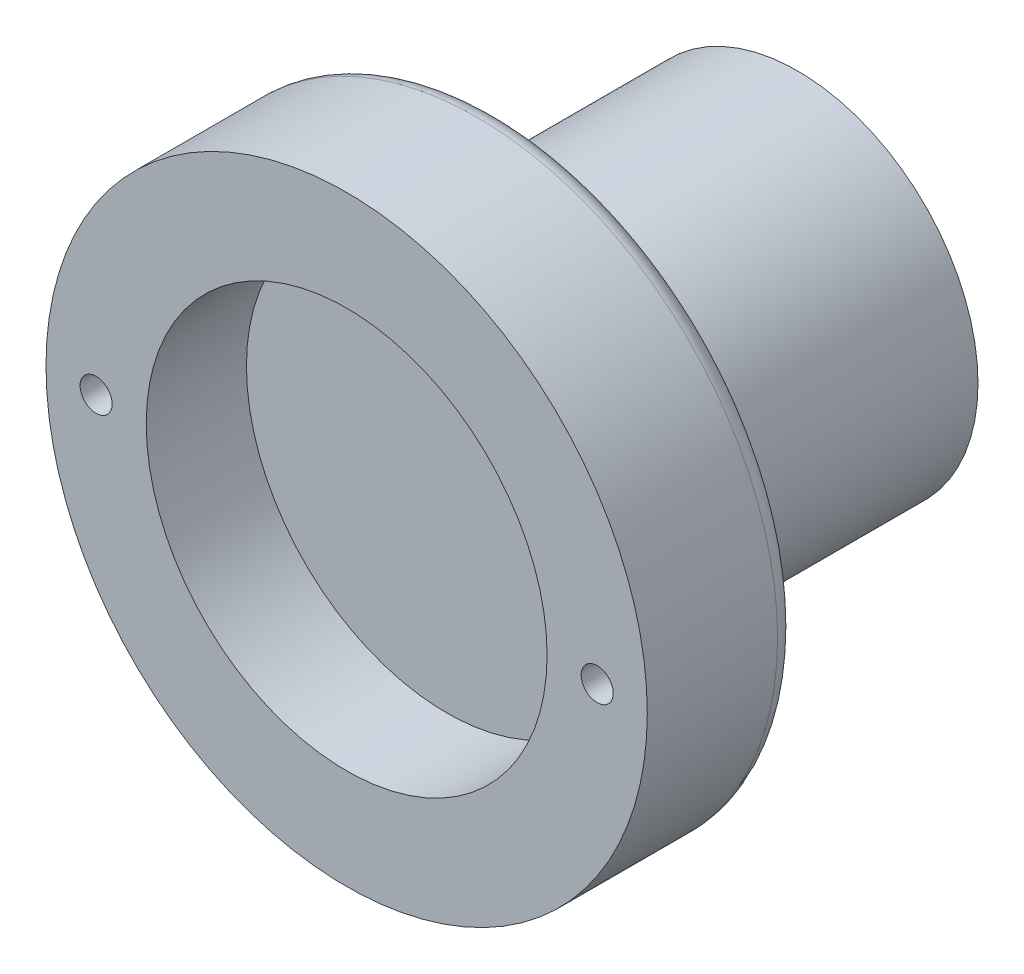
ISO-10303-21;
HEADER;
FILE_DESCRIPTION(('STEP AP214'),'2;1');
FILE_NAME('part.step','',(''),(''),'','','');
FILE_SCHEMA(('AUTOMOTIVE_DESIGN { 1 0 10303 214 1 1 1 1 }'));
ENDSEC;
DATA;
#1=APPLICATION_CONTEXT('core data for automotive mechanical design processes');
#2=APPLICATION_PROTOCOL_DEFINITION('international standard','automotive_design',2000,#1);
#3=PRODUCT_CONTEXT('',#1,'mechanical');
#4=PRODUCT('Part','Part','',(#3));
#5=PRODUCT_RELATED_PRODUCT_CATEGORY('part','',(#4));
#6=PRODUCT_DEFINITION_FORMATION('','',#4);
#7=PRODUCT_DEFINITION_CONTEXT('part definition',#1,'design');
#8=PRODUCT_DEFINITION('design','',#6,#7);
#9=PRODUCT_DEFINITION_SHAPE('','',#8);
#10=(LENGTH_UNIT() NAMED_UNIT(*) SI_UNIT(.MILLI.,.METRE.));
#11=(NAMED_UNIT(*) PLANE_ANGLE_UNIT() SI_UNIT($,.RADIAN.));
#12=(NAMED_UNIT(*) SI_UNIT($,.STERADIAN.) SOLID_ANGLE_UNIT());
#13=UNCERTAINTY_MEASURE_WITH_UNIT(LENGTH_MEASURE(1.E-05),#10,'distance_accuracy_value','');
#14=(GEOMETRIC_REPRESENTATION_CONTEXT(3) GLOBAL_UNCERTAINTY_ASSIGNED_CONTEXT((#13)) GLOBAL_UNIT_ASSIGNED_CONTEXT((#10,
#11,#12)) REPRESENTATION_CONTEXT('',''));
#15=CARTESIAN_POINT('',(0.,0.,0.));
#16=DIRECTION('',(0.,0.,1.));
#17=DIRECTION('',(1.,0.,0.));
#18=AXIS2_PLACEMENT_3D('',#15,#16,#17);
#19=CARTESIAN_POINT('',(0.,0.,2.));
#20=DIRECTION('',(0.,0.,1.));
#21=DIRECTION('',(1.,0.,0.));
#22=AXIS2_PLACEMENT_3D('',#19,#20,#21);
#23=TOROIDAL_SURFACE('',#22,28.,2.);
#24=CARTESIAN_POINT('',(0.,0.,0.));
#25=DIRECTION('',(0.,0.,1.));
#26=DIRECTION('',(1.,0.,0.));
#27=AXIS2_PLACEMENT_3D('',#24,#25,#26);
#28=CIRCLE('',#27,28.);
#29=CARTESIAN_POINT('',(28.,0.,0.));
#30=VERTEX_POINT('',#29);
#31=EDGE_CURVE('E40',#30,#30,#28,.F.);
#32=ORIENTED_EDGE('',*,*,#31,.F.);
#33=EDGE_LOOP('',(#32));
#34=FACE_BOUND('',#33,.T.);
#35=CARTESIAN_POINT('',(0.,0.,2.));
#36=DIRECTION('',(0.,0.,1.));
#37=DIRECTION('',(1.,0.,0.));
#38=AXIS2_PLACEMENT_3D('',#35,#36,#37);
#39=CIRCLE('',#38,30.);
#40=CARTESIAN_POINT('',(30.,0.,2.));
#41=VERTEX_POINT('',#40);
#42=EDGE_CURVE('E10',#41,#41,#39,.T.);
#43=ORIENTED_EDGE('',*,*,#42,.F.);
#44=EDGE_LOOP('',(#43));
#45=FACE_BOUND('',#44,.T.);
#46=ADVANCED_FACE('F34',(#34,#45),#23,.T.);
#47=CARTESIAN_POINT('',(0.,0.,15.));
#48=DIRECTION('',(0.,0.,1.));
#49=DIRECTION('',(1.,0.,0.));
#50=AXIS2_PLACEMENT_3D('',#47,#48,#49);
#51=PLANE('',#50);
#52=CARTESIAN_POINT('',(0.,0.,15.));
#53=DIRECTION('',(0.,0.,1.));
#54=DIRECTION('',(1.,0.,0.));
#55=AXIS2_PLACEMENT_3D('',#52,#53,#54);
#56=CIRCLE('',#55,20.);
#57=CARTESIAN_POINT('',(20.,0.,15.));
#58=VERTEX_POINT('',#57);
#59=EDGE_CURVE('E66',#58,#58,#56,.T.);
#60=ORIENTED_EDGE('',*,*,#59,.F.);
#61=EDGE_LOOP('',(#60));
#62=FACE_BOUND('',#61,.T.);
#63=CARTESIAN_POINT('',(-25.,0.,15.));
#64=DIRECTION('',(0.,0.,1.));
#65=DIRECTION('',(1.,0.,0.));
#66=AXIS2_PLACEMENT_3D('',#63,#64,#65);
#67=CIRCLE('',#66,1.6);
#68=CARTESIAN_POINT('',(-23.4,0.,15.));
#69=VERTEX_POINT('',#68);
#70=EDGE_CURVE('E53',#69,#69,#67,.T.);
#71=ORIENTED_EDGE('',*,*,#70,.F.);
#72=EDGE_LOOP('',(#71));
#73=FACE_BOUND('',#72,.T.);
#74=CARTESIAN_POINT('',(0.,0.,15.));
#75=DIRECTION('',(0.,0.,1.));
#76=DIRECTION('',(1.,0.,0.));
#77=AXIS2_PLACEMENT_3D('',#74,#75,#76);
#78=CIRCLE('',#77,30.);
#79=CARTESIAN_POINT('',(30.,0.,15.));
#80=VERTEX_POINT('',#79);
#81=EDGE_CURVE('E48',#80,#80,#78,.T.);
#82=ORIENTED_EDGE('',*,*,#81,.T.);
#83=EDGE_LOOP('',(#82));
#84=FACE_BOUND('',#83,.T.);
#85=CARTESIAN_POINT('',(25.,0.,15.));
#86=DIRECTION('',(0.,0.,1.));
#87=DIRECTION('',(1.,0.,0.));
#88=AXIS2_PLACEMENT_3D('',#85,#86,#87);
#89=CIRCLE('',#88,1.6);
#90=CARTESIAN_POINT('',(26.6,0.,15.));
#91=VERTEX_POINT('',#90);
#92=EDGE_CURVE('E57',#91,#91,#89,.T.);
#93=ORIENTED_EDGE('',*,*,#92,.F.);
#94=EDGE_LOOP('',(#93));
#95=FACE_BOUND('',#94,.T.);
#96=ADVANCED_FACE('F106',(#62,#73,#84,#95),#51,.T.);
#97=CARTESIAN_POINT('',(0.,0.,0.));
#98=DIRECTION('',(0.,0.,1.));
#99=DIRECTION('',(1.,0.,0.));
#100=AXIS2_PLACEMENT_3D('',#97,#98,#99);
#101=PLANE('',#100);
#102=ORIENTED_EDGE('',*,*,#31,.T.);
#103=EDGE_LOOP('',(#102));
#104=FACE_BOUND('',#103,.T.);
#105=CARTESIAN_POINT('',(0.,0.,0.));
#106=DIRECTION('',(0.,0.,-1.));
#107=DIRECTION('',(-1.,0.,0.));
#108=AXIS2_PLACEMENT_3D('',#105,#106,#107);
#109=CIRCLE('',#108,18.);
#110=CARTESIAN_POINT('',(-18.,0.,0.));
#111=VERTEX_POINT('',#110);
#112=EDGE_CURVE('E44',#111,#111,#109,.T.);
#113=ORIENTED_EDGE('',*,*,#112,.F.);
#114=EDGE_LOOP('',(#113));
#115=FACE_BOUND('',#114,.T.);
#116=CARTESIAN_POINT('',(-25.,0.,0.));
#117=DIRECTION('',(0.,0.,1.));
#118=DIRECTION('',(1.,0.,0.));
#119=AXIS2_PLACEMENT_3D('',#116,#117,#118);
#120=CIRCLE('',#119,1.6);
#121=CARTESIAN_POINT('',(-23.4,0.,0.));
#122=VERTEX_POINT('',#121);
#123=EDGE_CURVE('E54',#122,#122,#120,.T.);
#124=ORIENTED_EDGE('',*,*,#123,.T.);
#125=EDGE_LOOP('',(#124));
#126=FACE_BOUND('',#125,.T.);
#127=CARTESIAN_POINT('',(25.,0.,0.));
#128=DIRECTION('',(0.,0.,1.));
#129=DIRECTION('',(1.,0.,0.));
#130=AXIS2_PLACEMENT_3D('',#127,#128,#129);
#131=CIRCLE('',#130,1.6);
#132=CARTESIAN_POINT('',(26.6,0.,0.));
#133=VERTEX_POINT('',#132);
#134=EDGE_CURVE('E60',#133,#133,#131,.T.);
#135=ORIENTED_EDGE('',*,*,#134,.T.);
#136=EDGE_LOOP('',(#135));
#137=FACE_BOUND('',#136,.T.);
#138=ADVANCED_FACE('F102',(#104,#115,#126,#137),#101,.F.);
#139=CARTESIAN_POINT('',(0.,0.,15.));
#140=DIRECTION('',(0.,0.,-1.));
#141=DIRECTION('',(-1.,0.,0.));
#142=AXIS2_PLACEMENT_3D('',#139,#140,#141);
#143=CYLINDRICAL_SURFACE('',#142,30.);
#144=ORIENTED_EDGE('',*,*,#42,.T.);
#145=EDGE_LOOP('',(#144));
#146=FACE_BOUND('',#145,.T.);
#147=ORIENTED_EDGE('',*,*,#81,.F.);
#148=EDGE_LOOP('',(#147));
#149=FACE_BOUND('',#148,.T.);
#150=ADVANCED_FACE('F105',(#146,#149),#143,.T.);
#151=CARTESIAN_POINT('',(-25.,0.,15.));
#152=DIRECTION('',(0.,0.,-1.));
#153=DIRECTION('',(-1.,0.,0.));
#154=AXIS2_PLACEMENT_3D('',#151,#152,#153);
#155=CYLINDRICAL_SURFACE('',#154,1.6);
#156=ORIENTED_EDGE('',*,*,#70,.T.);
#157=EDGE_LOOP('',(#156));
#158=FACE_BOUND('',#157,.T.);
#159=ORIENTED_EDGE('',*,*,#123,.F.);
#160=EDGE_LOOP('',(#159));
#161=FACE_BOUND('',#160,.T.);
#162=ADVANCED_FACE('F115',(#158,#161),#155,.F.);
#163=CARTESIAN_POINT('',(25.,0.,15.));
#164=DIRECTION('',(0.,0.,-1.));
#165=DIRECTION('',(-1.,0.,0.));
#166=AXIS2_PLACEMENT_3D('',#163,#164,#165);
#167=CYLINDRICAL_SURFACE('',#166,1.6);
#168=ORIENTED_EDGE('',*,*,#92,.T.);
#169=EDGE_LOOP('',(#168));
#170=FACE_BOUND('',#169,.T.);
#171=ORIENTED_EDGE('',*,*,#134,.F.);
#172=EDGE_LOOP('',(#171));
#173=FACE_BOUND('',#172,.T.);
#174=ADVANCED_FACE('F112',(#170,#173),#167,.F.);
#175=CARTESIAN_POINT('',(0.,0.,5.));
#176=DIRECTION('',(0.,0.,1.));
#177=DIRECTION('',(1.,0.,0.));
#178=AXIS2_PLACEMENT_3D('',#175,#176,#177);
#179=CYLINDRICAL_SURFACE('',#178,20.);
#180=CARTESIAN_POINT('',(0.,0.,5.));
#181=DIRECTION('',(0.,0.,1.));
#182=DIRECTION('',(1.,0.,0.));
#183=AXIS2_PLACEMENT_3D('',#180,#181,#182);
#184=CIRCLE('',#183,20.);
#185=CARTESIAN_POINT('',(20.,0.,5.));
#186=VERTEX_POINT('',#185);
#187=EDGE_CURVE('E63',#186,#186,#184,.T.);
#188=ORIENTED_EDGE('',*,*,#187,.F.);
#189=EDGE_LOOP('',(#188));
#190=FACE_BOUND('',#189,.T.);
#191=ORIENTED_EDGE('',*,*,#59,.T.);
#192=EDGE_LOOP('',(#191));
#193=FACE_BOUND('',#192,.T.);
#194=ADVANCED_FACE('F114',(#190,#193),#179,.F.);
#195=CARTESIAN_POINT('',(0.,0.,5.));
#196=DIRECTION('',(0.,0.,1.));
#197=DIRECTION('',(1.,0.,0.));
#198=AXIS2_PLACEMENT_3D('',#195,#196,#197);
#199=PLANE('',#198);
#200=ORIENTED_EDGE('',*,*,#187,.T.);
#201=EDGE_LOOP('',(#200));
#202=FACE_BOUND('',#201,.T.);
#203=ADVANCED_FACE('F98',(#202),#199,.T.);
#204=CARTESIAN_POINT('',(0.,0.,-30.));
#205=DIRECTION('',(0.,0.,1.));
#206=DIRECTION('',(1.,0.,0.));
#207=AXIS2_PLACEMENT_3D('',#204,#205,#206);
#208=CYLINDRICAL_SURFACE('',#207,18.);
#209=CARTESIAN_POINT('',(0.,0.,-30.));
#210=DIRECTION('',(0.,0.,-1.));
#211=DIRECTION('',(-1.,0.,0.));
#212=AXIS2_PLACEMENT_3D('',#209,#210,#211);
#213=CIRCLE('',#212,18.);
#214=CARTESIAN_POINT('',(-18.,0.,-30.));
#215=VERTEX_POINT('',#214);
#216=EDGE_CURVE('E69',#215,#215,#213,.T.);
#217=ORIENTED_EDGE('',*,*,#216,.F.);
#218=EDGE_LOOP('',(#217));
#219=FACE_BOUND('',#218,.T.);
#220=ORIENTED_EDGE('',*,*,#112,.T.);
#221=EDGE_LOOP('',(#220));
#222=FACE_BOUND('',#221,.T.);
#223=ADVANCED_FACE('F92',(#219,#222),#208,.T.);
#224=CARTESIAN_POINT('',(0.,0.,-30.));
#225=DIRECTION('',(0.,0.,-1.));
#226=DIRECTION('',(-1.,0.,0.));
#227=AXIS2_PLACEMENT_3D('',#224,#225,#226);
#228=PLANE('',#227);
#229=CARTESIAN_POINT('',(0.,0.,-30.));
#230=DIRECTION('',(0.,0.,-1.));
#231=DIRECTION('',(-1.,0.,0.));
#232=AXIS2_PLACEMENT_3D('',#229,#230,#231);
#233=CIRCLE('',#232,16.);
#234=CARTESIAN_POINT('',(-16.,0.,-30.));
#235=VERTEX_POINT('',#234);
#236=EDGE_CURVE('E75',#235,#235,#233,.T.);
#237=ORIENTED_EDGE('',*,*,#236,.F.);
#238=EDGE_LOOP('',(#237));
#239=FACE_BOUND('',#238,.T.);
#240=ORIENTED_EDGE('',*,*,#216,.T.);
#241=EDGE_LOOP('',(#240));
#242=FACE_BOUND('',#241,.T.);
#243=ADVANCED_FACE('F86',(#239,#242),#228,.T.);
#244=CARTESIAN_POINT('',(0.,0.,-5.));
#245=DIRECTION('',(0.,0.,-1.));
#246=DIRECTION('',(-1.,0.,0.));
#247=AXIS2_PLACEMENT_3D('',#244,#245,#246);
#248=CYLINDRICAL_SURFACE('',#247,16.);
#249=CARTESIAN_POINT('',(0.,0.,-5.));
#250=DIRECTION('',(0.,0.,-1.));
#251=DIRECTION('',(-1.,0.,0.));
#252=AXIS2_PLACEMENT_3D('',#249,#250,#251);
#253=CIRCLE('',#252,16.);
#254=CARTESIAN_POINT('',(-16.,0.,-5.));
#255=VERTEX_POINT('',#254);
#256=EDGE_CURVE('E74',#255,#255,#253,.T.);
#257=ORIENTED_EDGE('',*,*,#256,.F.);
#258=EDGE_LOOP('',(#257));
#259=FACE_BOUND('',#258,.T.);
#260=ORIENTED_EDGE('',*,*,#236,.T.);
#261=EDGE_LOOP('',(#260));
#262=FACE_BOUND('',#261,.T.);
#263=ADVANCED_FACE('F83',(#259,#262),#248,.F.);
#264=CARTESIAN_POINT('',(0.,0.,-5.));
#265=DIRECTION('',(0.,0.,-1.));
#266=DIRECTION('',(-1.,0.,0.));
#267=AXIS2_PLACEMENT_3D('',#264,#265,#266);
#268=PLANE('',#267);
#269=ORIENTED_EDGE('',*,*,#256,.T.);
#270=EDGE_LOOP('',(#269));
#271=FACE_BOUND('',#270,.T.);
#272=ADVANCED_FACE('F81',(#271),#268,.T.);
#273=CLOSED_SHELL('',(#46,#96,#138,#150,#162,#174,#194,#203,#223,#243,#263,#272));
#274=MANIFOLD_SOLID_BREP('B2',#273);
#275=ADVANCED_BREP_SHAPE_REPRESENTATION('',(#18,#274),#14);
#276=SHAPE_DEFINITION_REPRESENTATION(#9,#275);
ENDSEC;
END-ISO-10303-21;
